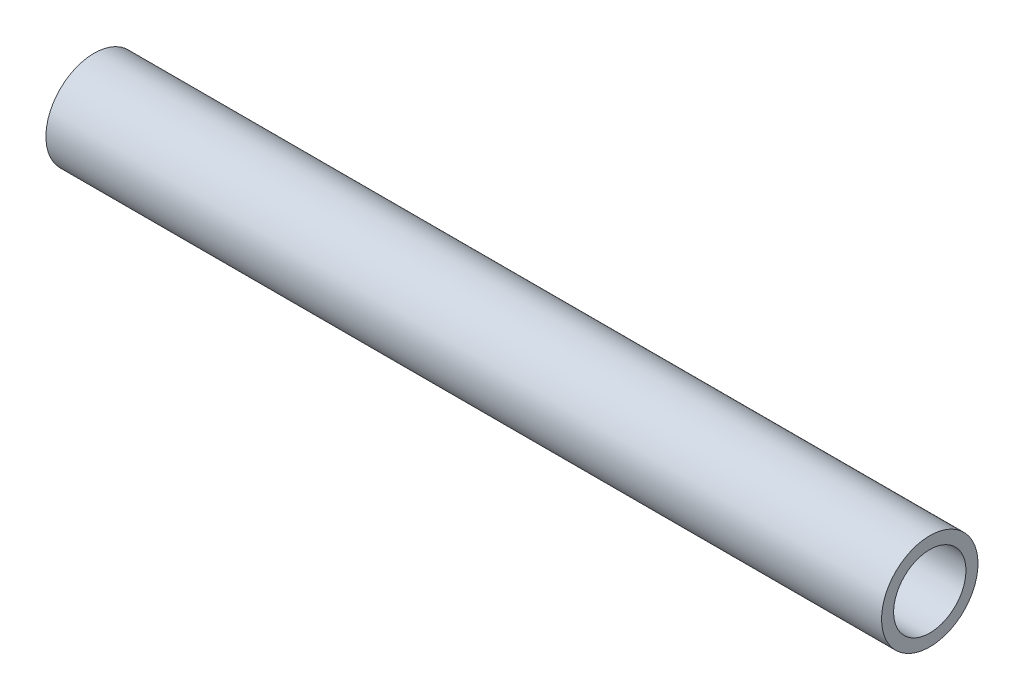
ISO-10303-21;
HEADER;
FILE_DESCRIPTION(('STEP AP214'),'2;1');
FILE_NAME('part.step','',(''),(''),'','','');
FILE_SCHEMA(('AUTOMOTIVE_DESIGN { 1 0 10303 214 1 1 1 1 }'));
ENDSEC;
DATA;
#1=APPLICATION_CONTEXT('core data for automotive mechanical design processes');
#2=APPLICATION_PROTOCOL_DEFINITION('international standard','automotive_design',2000,#1);
#3=PRODUCT_CONTEXT('',#1,'mechanical');
#4=PRODUCT('Part','Part','',(#3));
#5=PRODUCT_RELATED_PRODUCT_CATEGORY('part','',(#4));
#6=PRODUCT_DEFINITION_FORMATION('','',#4);
#7=PRODUCT_DEFINITION_CONTEXT('part definition',#1,'design');
#8=PRODUCT_DEFINITION('design','',#6,#7);
#9=PRODUCT_DEFINITION_SHAPE('','',#8);
#10=(LENGTH_UNIT() NAMED_UNIT(*) SI_UNIT(.MILLI.,.METRE.));
#11=(NAMED_UNIT(*) PLANE_ANGLE_UNIT() SI_UNIT($,.RADIAN.));
#12=(NAMED_UNIT(*) SI_UNIT($,.STERADIAN.) SOLID_ANGLE_UNIT());
#13=UNCERTAINTY_MEASURE_WITH_UNIT(LENGTH_MEASURE(1.E-05),#10,'distance_accuracy_value','');
#14=(GEOMETRIC_REPRESENTATION_CONTEXT(3) GLOBAL_UNCERTAINTY_ASSIGNED_CONTEXT((#13)) GLOBAL_UNIT_ASSIGNED_CONTEXT((#10,
#11,#12)) REPRESENTATION_CONTEXT('',''));
#15=CARTESIAN_POINT('',(0.,0.,0.));
#16=DIRECTION('',(0.,0.,1.));
#17=DIRECTION('',(1.,0.,0.));
#18=AXIS2_PLACEMENT_3D('',#15,#16,#17);
#19=CARTESIAN_POINT('',(26.,0.,0.));
#20=DIRECTION('',(1.,0.,0.));
#21=DIRECTION('',(0.,0.,-1.));
#22=AXIS2_PLACEMENT_3D('',#19,#20,#21);
#23=PLANE('',#22);
#24=CARTESIAN_POINT('',(26.,0.,0.));
#25=DIRECTION('',(1.,0.,0.));
#26=DIRECTION('',(0.,0.,-1.));
#27=AXIS2_PLACEMENT_3D('',#24,#25,#26);
#28=CIRCLE('',#27,3.);
#29=CARTESIAN_POINT('',(26.,0.,-3.));
#30=VERTEX_POINT('',#29);
#31=EDGE_CURVE('E10',#30,#30,#28,.T.);
#32=ORIENTED_EDGE('',*,*,#31,.T.);
#33=EDGE_LOOP('',(#32));
#34=FACE_BOUND('',#33,.T.);
#35=CARTESIAN_POINT('',(26.,0.,0.));
#36=DIRECTION('',(1.,0.,0.));
#37=DIRECTION('',(0.,0.,-1.));
#38=AXIS2_PLACEMENT_3D('',#35,#36,#37);
#39=CIRCLE('',#38,2.25);
#40=CARTESIAN_POINT('',(26.,0.,-2.25));
#41=VERTEX_POINT('',#40);
#42=EDGE_CURVE('E54',#41,#41,#39,.T.);
#43=ORIENTED_EDGE('',*,*,#42,.F.);
#44=EDGE_LOOP('',(#43));
#45=FACE_BOUND('',#44,.T.);
#46=ADVANCED_FACE('F41',(#34,#45),#23,.T.);
#47=CARTESIAN_POINT('',(-26.,0.,0.));
#48=DIRECTION('',(1.,0.,0.));
#49=DIRECTION('',(0.,0.,-1.));
#50=AXIS2_PLACEMENT_3D('',#47,#48,#49);
#51=PLANE('',#50);
#52=CARTESIAN_POINT('',(-26.,0.,0.));
#53=DIRECTION('',(1.,0.,0.));
#54=DIRECTION('',(0.,0.,-1.));
#55=AXIS2_PLACEMENT_3D('',#52,#53,#54);
#56=CIRCLE('',#55,3.);
#57=CARTESIAN_POINT('',(-26.,0.,-3.));
#58=VERTEX_POINT('',#57);
#59=EDGE_CURVE('E45',#58,#58,#56,.T.);
#60=ORIENTED_EDGE('',*,*,#59,.F.);
#61=EDGE_LOOP('',(#60));
#62=FACE_BOUND('',#61,.T.);
#63=CARTESIAN_POINT('',(-26.,0.,0.));
#64=DIRECTION('',(1.,0.,0.));
#65=DIRECTION('',(0.,0.,-1.));
#66=AXIS2_PLACEMENT_3D('',#63,#64,#65);
#67=CIRCLE('',#66,2.25);
#68=CARTESIAN_POINT('',(-26.,0.,-2.25));
#69=VERTEX_POINT('',#68);
#70=EDGE_CURVE('E56',#69,#69,#67,.T.);
#71=ORIENTED_EDGE('',*,*,#70,.T.);
#72=EDGE_LOOP('',(#71));
#73=FACE_BOUND('',#72,.T.);
#74=ADVANCED_FACE('F68',(#62,#73),#51,.F.);
#75=CARTESIAN_POINT('',(26.,0.,0.));
#76=DIRECTION('',(-1.,0.,0.));
#77=DIRECTION('',(0.,0.,1.));
#78=AXIS2_PLACEMENT_3D('',#75,#76,#77);
#79=CYLINDRICAL_SURFACE('',#78,3.);
#80=ORIENTED_EDGE('',*,*,#31,.F.);
#81=EDGE_LOOP('',(#80));
#82=FACE_BOUND('',#81,.T.);
#83=ORIENTED_EDGE('',*,*,#59,.T.);
#84=EDGE_LOOP('',(#83));
#85=FACE_BOUND('',#84,.T.);
#86=ADVANCED_FACE('F43',(#82,#85),#79,.T.);
#87=CARTESIAN_POINT('',(26.,0.,0.));
#88=DIRECTION('',(-1.,0.,0.));
#89=DIRECTION('',(0.,0.,1.));
#90=AXIS2_PLACEMENT_3D('',#87,#88,#89);
#91=CYLINDRICAL_SURFACE('',#90,2.25);
#92=ORIENTED_EDGE('',*,*,#42,.T.);
#93=EDGE_LOOP('',(#92));
#94=FACE_BOUND('',#93,.T.);
#95=ORIENTED_EDGE('',*,*,#70,.F.);
#96=EDGE_LOOP('',(#95));
#97=FACE_BOUND('',#96,.T.);
#98=ADVANCED_FACE('F64',(#94,#97),#91,.F.);
#99=CLOSED_SHELL('',(#46,#74,#86,#98));
#100=MANIFOLD_SOLID_BREP('B2',#99);
#101=ADVANCED_BREP_SHAPE_REPRESENTATION('',(#18,#100),#14);
#102=SHAPE_DEFINITION_REPRESENTATION(#9,#101);
ENDSEC;
END-ISO-10303-21;
